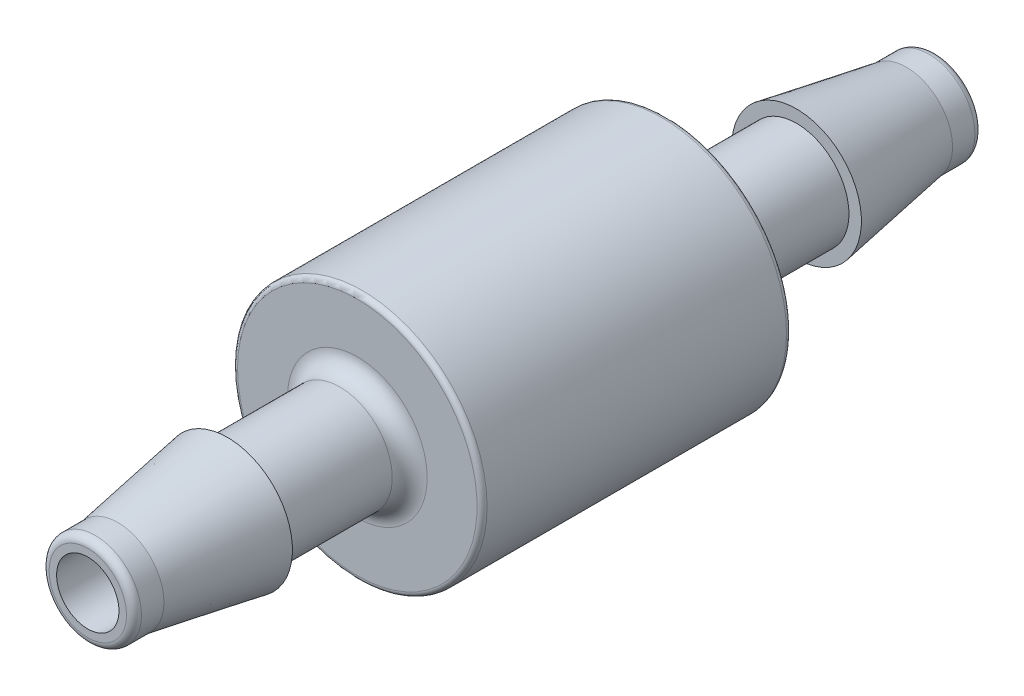
ISO-10303-21;
HEADER;
FILE_DESCRIPTION(('STEP AP214'),'2;1');
FILE_NAME('part.step','',(''),(''),'','','');
FILE_SCHEMA(('AUTOMOTIVE_DESIGN { 1 0 10303 214 1 1 1 1 }'));
ENDSEC;
DATA;
#1=APPLICATION_CONTEXT('core data for automotive mechanical design processes');
#2=APPLICATION_PROTOCOL_DEFINITION('international standard','automotive_design',2000,#1);
#3=PRODUCT_CONTEXT('',#1,'mechanical');
#4=PRODUCT('Part','Part','',(#3));
#5=PRODUCT_RELATED_PRODUCT_CATEGORY('part','',(#4));
#6=PRODUCT_DEFINITION_FORMATION('','',#4);
#7=PRODUCT_DEFINITION_CONTEXT('part definition',#1,'design');
#8=PRODUCT_DEFINITION('design','',#6,#7);
#9=PRODUCT_DEFINITION_SHAPE('','',#8);
#10=(LENGTH_UNIT() NAMED_UNIT(*) SI_UNIT(.MILLI.,.METRE.));
#11=(NAMED_UNIT(*) PLANE_ANGLE_UNIT() SI_UNIT($,.RADIAN.));
#12=(NAMED_UNIT(*) SI_UNIT($,.STERADIAN.) SOLID_ANGLE_UNIT());
#13=UNCERTAINTY_MEASURE_WITH_UNIT(LENGTH_MEASURE(1.E-05),#10,'distance_accuracy_value','');
#14=(GEOMETRIC_REPRESENTATION_CONTEXT(3) GLOBAL_UNCERTAINTY_ASSIGNED_CONTEXT((#13)) GLOBAL_UNIT_ASSIGNED_CONTEXT((#10,
#11,#12)) REPRESENTATION_CONTEXT('',''));
#15=CARTESIAN_POINT('',(0.,0.,0.));
#16=DIRECTION('',(0.,0.,1.));
#17=DIRECTION('',(1.,0.,0.));
#18=AXIS2_PLACEMENT_3D('',#15,#16,#17);
#19=CARTESIAN_POINT('',(0.,-3.302,14.478));
#20=DIRECTION('',(0.,0.,-1.));
#21=DIRECTION('',(-1.,0.,0.));
#22=AXIS2_PLACEMENT_3D('',#19,#20,#21);
#23=PLANE('',#22);
#24=CARTESIAN_POINT('',(0.,0.,14.478));
#25=DIRECTION('',(0.,0.,-1.));
#26=DIRECTION('',(-1.,0.,0.));
#27=AXIS2_PLACEMENT_3D('',#24,#25,#26);
#28=CIRCLE('',#27,3.30199999999999);
#29=CARTESIAN_POINT('',(-3.30199999999999,0.,14.478));
#30=VERTEX_POINT('',#29);
#31=EDGE_CURVE('E10',#30,#30,#28,.T.);
#32=ORIENTED_EDGE('',*,*,#31,.T.);
#33=EDGE_LOOP('',(#32));
#34=FACE_BOUND('',#33,.T.);
#35=CARTESIAN_POINT('',(0.,0.,14.478));
#36=DIRECTION('',(0.,0.,-1.));
#37=DIRECTION('',(-1.,0.,0.));
#38=AXIS2_PLACEMENT_3D('',#35,#36,#37);
#39=CIRCLE('',#38,2.66699999999999);
#40=CARTESIAN_POINT('',(-2.66699999999999,0.,14.478));
#41=VERTEX_POINT('',#40);
#42=EDGE_CURVE('E124',#41,#41,#39,.T.);
#43=ORIENTED_EDGE('',*,*,#42,.F.);
#44=EDGE_LOOP('',(#43));
#45=FACE_BOUND('',#44,.T.);
#46=ADVANCED_FACE('F39',(#34,#45),#23,.T.);
#47=CARTESIAN_POINT('',(0.,0.,14.478));
#48=DIRECTION('',(0.,0.,-1.));
#49=DIRECTION('',(-1.,0.,0.));
#50=AXIS2_PLACEMENT_3D('',#47,#48,#49);
#51=CONICAL_SURFACE('',#50,3.30199999999999,0.168831902011121);
#52=CARTESIAN_POINT('',(0.,0.,20.066));
#53=DIRECTION('',(0.,0.,-1.));
#54=DIRECTION('',(-1.,0.,0.));
#55=AXIS2_PLACEMENT_3D('',#52,#53,#54);
#56=CIRCLE('',#55,2.34949999999999);
#57=CARTESIAN_POINT('',(-2.34949999999999,0.,20.066));
#58=VERTEX_POINT('',#57);
#59=EDGE_CURVE('E46',#58,#58,#56,.T.);
#60=ORIENTED_EDGE('',*,*,#59,.T.);
#61=EDGE_LOOP('',(#60));
#62=FACE_BOUND('',#61,.T.);
#63=ORIENTED_EDGE('',*,*,#31,.F.);
#64=EDGE_LOOP('',(#63));
#65=FACE_BOUND('',#64,.T.);
#66=ADVANCED_FACE('F134',(#62,#65),#51,.T.);
#67=CARTESIAN_POINT('',(0.,0.,-21.59));
#68=DIRECTION('',(0.,0.,-1.));
#69=DIRECTION('',(-1.,0.,0.));
#70=AXIS2_PLACEMENT_3D('',#67,#68,#69);
#71=CYLINDRICAL_SURFACE('',#70,2.34949999999999);
#72=CARTESIAN_POINT('',(0.,0.,21.209));
#73=DIRECTION('',(0.,0.,-1.));
#74=DIRECTION('',(-1.,0.,0.));
#75=AXIS2_PLACEMENT_3D('',#72,#73,#74);
#76=CIRCLE('',#75,2.34949999999999);
#77=CARTESIAN_POINT('',(-2.34949999999999,0.,21.209));
#78=VERTEX_POINT('',#77);
#79=EDGE_CURVE('E52',#78,#78,#76,.T.);
#80=ORIENTED_EDGE('',*,*,#79,.T.);
#81=EDGE_LOOP('',(#80));
#82=FACE_BOUND('',#81,.T.);
#83=ORIENTED_EDGE('',*,*,#59,.F.);
#84=EDGE_LOOP('',(#83));
#85=FACE_BOUND('',#84,.T.);
#86=ADVANCED_FACE('F138',(#82,#85),#71,.T.);
#87=CARTESIAN_POINT('',(0.,0.,21.209));
#88=DIRECTION('',(0.,0.,-1.));
#89=DIRECTION('',(-1.,0.,0.));
#90=AXIS2_PLACEMENT_3D('',#87,#88,#89);
#91=TOROIDAL_SURFACE('',#90,1.96849999999999,0.381);
#92=CARTESIAN_POINT('',(0.,0.,21.59));
#93=DIRECTION('',(0.,0.,-1.));
#94=DIRECTION('',(-1.,0.,0.));
#95=AXIS2_PLACEMENT_3D('',#92,#93,#94);
#96=CIRCLE('',#95,1.96849999999999);
#97=CARTESIAN_POINT('',(-1.96849999999999,0.,21.59));
#98=VERTEX_POINT('',#97);
#99=EDGE_CURVE('E58',#98,#98,#96,.T.);
#100=ORIENTED_EDGE('',*,*,#99,.T.);
#101=EDGE_LOOP('',(#100));
#102=FACE_BOUND('',#101,.T.);
#103=ORIENTED_EDGE('',*,*,#79,.F.);
#104=EDGE_LOOP('',(#103));
#105=FACE_BOUND('',#104,.T.);
#106=ADVANCED_FACE('F142',(#102,#105),#91,.T.);
#107=CARTESIAN_POINT('',(0.,-1.5875,21.59));
#108=DIRECTION('',(0.,0.,1.));
#109=DIRECTION('',(1.,0.,0.));
#110=AXIS2_PLACEMENT_3D('',#107,#108,#109);
#111=PLANE('',#110);
#112=CARTESIAN_POINT('',(0.,0.,21.59));
#113=DIRECTION('',(0.,0.,-1.));
#114=DIRECTION('',(-1.,0.,0.));
#115=AXIS2_PLACEMENT_3D('',#112,#113,#114);
#116=CIRCLE('',#115,1.58749999999999);
#117=CARTESIAN_POINT('',(-1.58749999999999,0.,21.59));
#118=VERTEX_POINT('',#117);
#119=EDGE_CURVE('E64',#118,#118,#116,.T.);
#120=ORIENTED_EDGE('',*,*,#119,.T.);
#121=EDGE_LOOP('',(#120));
#122=FACE_BOUND('',#121,.T.);
#123=ORIENTED_EDGE('',*,*,#99,.F.);
#124=EDGE_LOOP('',(#123));
#125=FACE_BOUND('',#124,.T.);
#126=ADVANCED_FACE('F149',(#122,#125),#111,.T.);
#127=CARTESIAN_POINT('',(0.,0.,-21.59));
#128=DIRECTION('',(0.,0.,-1.));
#129=DIRECTION('',(-1.,0.,0.));
#130=AXIS2_PLACEMENT_3D('',#127,#128,#129);
#131=CYLINDRICAL_SURFACE('',#130,1.58749999999999);
#132=CARTESIAN_POINT('',(0.,0.,-21.59));
#133=DIRECTION('',(0.,0.,-1.));
#134=DIRECTION('',(-1.,0.,0.));
#135=AXIS2_PLACEMENT_3D('',#132,#133,#134);
#136=CIRCLE('',#135,1.58749999999999);
#137=CARTESIAN_POINT('',(-1.58749999999999,0.,-21.59));
#138=VERTEX_POINT('',#137);
#139=EDGE_CURVE('E68',#138,#138,#136,.T.);
#140=ORIENTED_EDGE('',*,*,#139,.T.);
#141=EDGE_LOOP('',(#140));
#142=FACE_BOUND('',#141,.T.);
#143=ORIENTED_EDGE('',*,*,#119,.F.);
#144=EDGE_LOOP('',(#143));
#145=FACE_BOUND('',#144,.T.);
#146=ADVANCED_FACE('F153',(#142,#145),#131,.F.);
#147=CARTESIAN_POINT('',(0.,-1.5875,-21.59));
#148=DIRECTION('',(0.,0.,-1.));
#149=DIRECTION('',(-1.,0.,0.));
#150=AXIS2_PLACEMENT_3D('',#147,#148,#149);
#151=PLANE('',#150);
#152=CARTESIAN_POINT('',(0.,0.,-21.59));
#153=DIRECTION('',(0.,0.,-1.));
#154=DIRECTION('',(-1.,0.,0.));
#155=AXIS2_PLACEMENT_3D('',#152,#153,#154);
#156=CIRCLE('',#155,1.96849999999999);
#157=CARTESIAN_POINT('',(-1.96849999999999,0.,-21.59));
#158=VERTEX_POINT('',#157);
#159=EDGE_CURVE('E72',#158,#158,#156,.T.);
#160=ORIENTED_EDGE('',*,*,#159,.T.);
#161=EDGE_LOOP('',(#160));
#162=FACE_BOUND('',#161,.T.);
#163=ORIENTED_EDGE('',*,*,#139,.F.);
#164=EDGE_LOOP('',(#163));
#165=FACE_BOUND('',#164,.T.);
#166=ADVANCED_FACE('F157',(#162,#165),#151,.T.);
#167=CARTESIAN_POINT('',(0.,0.,-21.209));
#168=DIRECTION('',(0.,0.,-1.));
#169=DIRECTION('',(-1.,0.,0.));
#170=AXIS2_PLACEMENT_3D('',#167,#168,#169);
#171=TOROIDAL_SURFACE('',#170,1.96849999999999,0.381);
#172=CARTESIAN_POINT('',(0.,0.,-21.209));
#173=DIRECTION('',(0.,0.,-1.));
#174=DIRECTION('',(-1.,0.,0.));
#175=AXIS2_PLACEMENT_3D('',#172,#173,#174);
#176=CIRCLE('',#175,2.34949999999999);
#177=CARTESIAN_POINT('',(-2.34949999999999,0.,-21.209));
#178=VERTEX_POINT('',#177);
#179=EDGE_CURVE('E76',#178,#178,#176,.T.);
#180=ORIENTED_EDGE('',*,*,#179,.T.);
#181=EDGE_LOOP('',(#180));
#182=FACE_BOUND('',#181,.T.);
#183=ORIENTED_EDGE('',*,*,#159,.F.);
#184=EDGE_LOOP('',(#183));
#185=FACE_BOUND('',#184,.T.);
#186=ADVANCED_FACE('F161',(#182,#185),#171,.T.);
#187=CARTESIAN_POINT('',(0.,0.,-21.59));
#188=DIRECTION('',(0.,0.,-1.));
#189=DIRECTION('',(-1.,0.,0.));
#190=AXIS2_PLACEMENT_3D('',#187,#188,#189);
#191=CYLINDRICAL_SURFACE('',#190,2.34949999999999);
#192=CARTESIAN_POINT('',(0.,0.,-20.066));
#193=DIRECTION('',(0.,0.,-1.));
#194=DIRECTION('',(-1.,0.,0.));
#195=AXIS2_PLACEMENT_3D('',#192,#193,#194);
#196=CIRCLE('',#195,2.34949999999999);
#197=CARTESIAN_POINT('',(-2.34949999999999,0.,-20.066));
#198=VERTEX_POINT('',#197);
#199=EDGE_CURVE('E80',#198,#198,#196,.T.);
#200=ORIENTED_EDGE('',*,*,#199,.T.);
#201=EDGE_LOOP('',(#200));
#202=FACE_BOUND('',#201,.T.);
#203=ORIENTED_EDGE('',*,*,#179,.F.);
#204=EDGE_LOOP('',(#203));
#205=FACE_BOUND('',#204,.T.);
#206=ADVANCED_FACE('F165',(#202,#205),#191,.T.);
#207=CARTESIAN_POINT('',(0.,0.,-20.066));
#208=DIRECTION('',(0.,0.,1.));
#209=DIRECTION('',(1.,0.,0.));
#210=AXIS2_PLACEMENT_3D('',#207,#208,#209);
#211=CONICAL_SURFACE('',#210,2.34949999999999,0.168831902011121);
#212=CARTESIAN_POINT('',(0.,0.,-14.478));
#213=DIRECTION('',(0.,0.,-1.));
#214=DIRECTION('',(-1.,0.,0.));
#215=AXIS2_PLACEMENT_3D('',#212,#213,#214);
#216=CIRCLE('',#215,3.30199999999999);
#217=CARTESIAN_POINT('',(-3.30199999999999,0.,-14.478));
#218=VERTEX_POINT('',#217);
#219=EDGE_CURVE('E84',#218,#218,#216,.T.);
#220=ORIENTED_EDGE('',*,*,#219,.T.);
#221=EDGE_LOOP('',(#220));
#222=FACE_BOUND('',#221,.T.);
#223=ORIENTED_EDGE('',*,*,#199,.F.);
#224=EDGE_LOOP('',(#223));
#225=FACE_BOUND('',#224,.T.);
#226=ADVANCED_FACE('F169',(#222,#225),#211,.T.);
#227=CARTESIAN_POINT('',(0.,-3.302,-14.478));
#228=DIRECTION('',(0.,0.,1.));
#229=DIRECTION('',(1.,0.,0.));
#230=AXIS2_PLACEMENT_3D('',#227,#228,#229);
#231=PLANE('',#230);
#232=CARTESIAN_POINT('',(0.,0.,-14.478));
#233=DIRECTION('',(0.,0.,-1.));
#234=DIRECTION('',(-1.,0.,0.));
#235=AXIS2_PLACEMENT_3D('',#232,#233,#234);
#236=CIRCLE('',#235,2.66699999999999);
#237=CARTESIAN_POINT('',(-2.66699999999999,0.,-14.478));
#238=VERTEX_POINT('',#237);
#239=EDGE_CURVE('E88',#238,#238,#236,.T.);
#240=ORIENTED_EDGE('',*,*,#239,.T.);
#241=EDGE_LOOP('',(#240));
#242=FACE_BOUND('',#241,.T.);
#243=ORIENTED_EDGE('',*,*,#219,.F.);
#244=EDGE_LOOP('',(#243));
#245=FACE_BOUND('',#244,.T.);
#246=ADVANCED_FACE('F173',(#242,#245),#231,.T.);
#247=CARTESIAN_POINT('',(0.,0.,-21.59));
#248=DIRECTION('',(0.,0.,-1.));
#249=DIRECTION('',(-1.,0.,0.));
#250=AXIS2_PLACEMENT_3D('',#247,#248,#249);
#251=CYLINDRICAL_SURFACE('',#250,2.66699999999999);
#252=CARTESIAN_POINT('',(0.,0.,-8.763));
#253=DIRECTION('',(0.,0.,-1.));
#254=DIRECTION('',(-1.,0.,0.));
#255=AXIS2_PLACEMENT_3D('',#252,#253,#254);
#256=CIRCLE('',#255,2.66699999999999);
#257=CARTESIAN_POINT('',(-2.66699999999999,0.,-8.763));
#258=VERTEX_POINT('',#257);
#259=EDGE_CURVE('E92',#258,#258,#256,.T.);
#260=ORIENTED_EDGE('',*,*,#259,.T.);
#261=EDGE_LOOP('',(#260));
#262=FACE_BOUND('',#261,.T.);
#263=ORIENTED_EDGE('',*,*,#239,.F.);
#264=EDGE_LOOP('',(#263));
#265=FACE_BOUND('',#264,.T.);
#266=ADVANCED_FACE('F177',(#262,#265),#251,.T.);
#267=CARTESIAN_POINT('',(0.,0.,-8.763));
#268=DIRECTION('',(0.,0.,-1.));
#269=DIRECTION('',(-1.,0.,0.));
#270=AXIS2_PLACEMENT_3D('',#267,#268,#269);
#271=TOROIDAL_SURFACE('',#270,3.55599999999999,0.889000000000001);
#272=CARTESIAN_POINT('',(0.,0.,-7.874));
#273=DIRECTION('',(0.,0.,-1.));
#274=DIRECTION('',(-1.,0.,0.));
#275=AXIS2_PLACEMENT_3D('',#272,#273,#274);
#276=CIRCLE('',#275,3.55599999999999);
#277=CARTESIAN_POINT('',(-3.55599999999999,0.,-7.874));
#278=VERTEX_POINT('',#277);
#279=EDGE_CURVE('E96',#278,#278,#276,.T.);
#280=ORIENTED_EDGE('',*,*,#279,.T.);
#281=EDGE_LOOP('',(#280));
#282=FACE_BOUND('',#281,.T.);
#283=ORIENTED_EDGE('',*,*,#259,.F.);
#284=EDGE_LOOP('',(#283));
#285=FACE_BOUND('',#284,.T.);
#286=ADVANCED_FACE('F181',(#282,#285),#271,.F.);
#287=CARTESIAN_POINT('',(0.,-3.55599999999999,-7.874));
#288=DIRECTION('',(0.,0.,-1.));
#289=DIRECTION('',(-1.,0.,0.));
#290=AXIS2_PLACEMENT_3D('',#287,#288,#289);
#291=PLANE('',#290);
#292=CARTESIAN_POINT('',(0.,0.,-7.87400000000001));
#293=DIRECTION('',(0.,0.,-1.));
#294=DIRECTION('',(-1.,0.,0.));
#295=AXIS2_PLACEMENT_3D('',#292,#293,#294);
#296=CIRCLE('',#295,6.09599999999999);
#297=CARTESIAN_POINT('',(-6.09599999999999,0.,-7.87400000000001));
#298=VERTEX_POINT('',#297);
#299=EDGE_CURVE('E100',#298,#298,#296,.T.);
#300=ORIENTED_EDGE('',*,*,#299,.T.);
#301=EDGE_LOOP('',(#300));
#302=FACE_BOUND('',#301,.T.);
#303=ORIENTED_EDGE('',*,*,#279,.F.);
#304=EDGE_LOOP('',(#303));
#305=FACE_BOUND('',#304,.T.);
#306=ADVANCED_FACE('F185',(#302,#305),#291,.T.);
#307=CARTESIAN_POINT('',(0.,0.,-7.62000000000001));
#308=DIRECTION('',(0.,0.,-1.));
#309=DIRECTION('',(-1.,0.,0.));
#310=AXIS2_PLACEMENT_3D('',#307,#308,#309);
#311=TOROIDAL_SURFACE('',#310,6.09599999999999,0.253999999999999);
#312=CARTESIAN_POINT('',(0.,0.,-7.62000000000001));
#313=DIRECTION('',(0.,0.,-1.));
#314=DIRECTION('',(-1.,0.,0.));
#315=AXIS2_PLACEMENT_3D('',#312,#313,#314);
#316=CIRCLE('',#315,6.34999999999999);
#317=CARTESIAN_POINT('',(-6.34999999999999,0.,-7.62000000000001));
#318=VERTEX_POINT('',#317);
#319=EDGE_CURVE('E104',#318,#318,#316,.T.);
#320=ORIENTED_EDGE('',*,*,#319,.T.);
#321=EDGE_LOOP('',(#320));
#322=FACE_BOUND('',#321,.T.);
#323=ORIENTED_EDGE('',*,*,#299,.F.);
#324=EDGE_LOOP('',(#323));
#325=FACE_BOUND('',#324,.T.);
#326=ADVANCED_FACE('F189',(#322,#325),#311,.T.);
#327=CARTESIAN_POINT('',(0.,0.,-21.59));
#328=DIRECTION('',(0.,0.,-1.));
#329=DIRECTION('',(-1.,0.,0.));
#330=AXIS2_PLACEMENT_3D('',#327,#328,#329);
#331=CYLINDRICAL_SURFACE('',#330,6.34999999999999);
#332=CARTESIAN_POINT('',(0.,0.,7.62));
#333=DIRECTION('',(0.,0.,-1.));
#334=DIRECTION('',(-1.,0.,0.));
#335=AXIS2_PLACEMENT_3D('',#332,#333,#334);
#336=CIRCLE('',#335,6.34999999999999);
#337=CARTESIAN_POINT('',(-6.34999999999999,0.,7.62));
#338=VERTEX_POINT('',#337);
#339=EDGE_CURVE('E108',#338,#338,#336,.T.);
#340=ORIENTED_EDGE('',*,*,#339,.T.);
#341=EDGE_LOOP('',(#340));
#342=FACE_BOUND('',#341,.T.);
#343=ORIENTED_EDGE('',*,*,#319,.F.);
#344=EDGE_LOOP('',(#343));
#345=FACE_BOUND('',#344,.T.);
#346=ADVANCED_FACE('F193',(#342,#345),#331,.T.);
#347=CARTESIAN_POINT('',(0.,0.,7.62));
#348=DIRECTION('',(0.,0.,-1.));
#349=DIRECTION('',(-1.,0.,0.));
#350=AXIS2_PLACEMENT_3D('',#347,#348,#349);
#351=TOROIDAL_SURFACE('',#350,6.09599999999999,0.253999999999999);
#352=CARTESIAN_POINT('',(0.,0.,7.874));
#353=DIRECTION('',(0.,0.,-1.));
#354=DIRECTION('',(-1.,0.,0.));
#355=AXIS2_PLACEMENT_3D('',#352,#353,#354);
#356=CIRCLE('',#355,6.09599999999999);
#357=CARTESIAN_POINT('',(-6.09599999999999,0.,7.874));
#358=VERTEX_POINT('',#357);
#359=EDGE_CURVE('E112',#358,#358,#356,.T.);
#360=ORIENTED_EDGE('',*,*,#359,.T.);
#361=EDGE_LOOP('',(#360));
#362=FACE_BOUND('',#361,.T.);
#363=ORIENTED_EDGE('',*,*,#339,.F.);
#364=EDGE_LOOP('',(#363));
#365=FACE_BOUND('',#364,.T.);
#366=ADVANCED_FACE('F197',(#362,#365),#351,.T.);
#367=CARTESIAN_POINT('',(0.,-3.55599999999999,7.874));
#368=DIRECTION('',(0.,0.,1.));
#369=DIRECTION('',(1.,0.,0.));
#370=AXIS2_PLACEMENT_3D('',#367,#368,#369);
#371=PLANE('',#370);
#372=CARTESIAN_POINT('',(0.,0.,7.874));
#373=DIRECTION('',(0.,0.,-1.));
#374=DIRECTION('',(-1.,0.,0.));
#375=AXIS2_PLACEMENT_3D('',#372,#373,#374);
#376=CIRCLE('',#375,3.55599999999999);
#377=CARTESIAN_POINT('',(-3.55599999999999,0.,7.874));
#378=VERTEX_POINT('',#377);
#379=EDGE_CURVE('E116',#378,#378,#376,.T.);
#380=ORIENTED_EDGE('',*,*,#379,.T.);
#381=EDGE_LOOP('',(#380));
#382=FACE_BOUND('',#381,.T.);
#383=ORIENTED_EDGE('',*,*,#359,.F.);
#384=EDGE_LOOP('',(#383));
#385=FACE_BOUND('',#384,.T.);
#386=ADVANCED_FACE('F201',(#382,#385),#371,.T.);
#387=CARTESIAN_POINT('',(0.,0.,8.763));
#388=DIRECTION('',(0.,0.,-1.));
#389=DIRECTION('',(-1.,0.,0.));
#390=AXIS2_PLACEMENT_3D('',#387,#388,#389);
#391=TOROIDAL_SURFACE('',#390,3.55599999999999,0.889000000000001);
#392=CARTESIAN_POINT('',(0.,0.,8.763));
#393=DIRECTION('',(0.,0.,-1.));
#394=DIRECTION('',(-1.,0.,0.));
#395=AXIS2_PLACEMENT_3D('',#392,#393,#394);
#396=CIRCLE('',#395,2.66699999999999);
#397=CARTESIAN_POINT('',(-2.66699999999999,0.,8.763));
#398=VERTEX_POINT('',#397);
#399=EDGE_CURVE('E120',#398,#398,#396,.T.);
#400=ORIENTED_EDGE('',*,*,#399,.T.);
#401=EDGE_LOOP('',(#400));
#402=FACE_BOUND('',#401,.T.);
#403=ORIENTED_EDGE('',*,*,#379,.F.);
#404=EDGE_LOOP('',(#403));
#405=FACE_BOUND('',#404,.T.);
#406=ADVANCED_FACE('F205',(#402,#405),#391,.F.);
#407=CARTESIAN_POINT('',(0.,0.,-21.59));
#408=DIRECTION('',(0.,0.,-1.));
#409=DIRECTION('',(-1.,0.,0.));
#410=AXIS2_PLACEMENT_3D('',#407,#408,#409);
#411=CYLINDRICAL_SURFACE('',#410,2.66699999999999);
#412=ORIENTED_EDGE('',*,*,#42,.T.);
#413=EDGE_LOOP('',(#412));
#414=FACE_BOUND('',#413,.T.);
#415=ORIENTED_EDGE('',*,*,#399,.F.);
#416=EDGE_LOOP('',(#415));
#417=FACE_BOUND('',#416,.T.);
#418=ADVANCED_FACE('F130',(#414,#417),#411,.T.);
#419=CLOSED_SHELL('',(#46,#66,#86,#106,#126,#146,#166,#186,#206,#226,#246,#266,#286,#306,#326,
#346,#366,#386,#406,#418));
#420=MANIFOLD_SOLID_BREP('B2',#419);
#421=ADVANCED_BREP_SHAPE_REPRESENTATION('',(#18,#420),#14);
#422=SHAPE_DEFINITION_REPRESENTATION(#9,#421);
ENDSEC;
END-ISO-10303-21;
